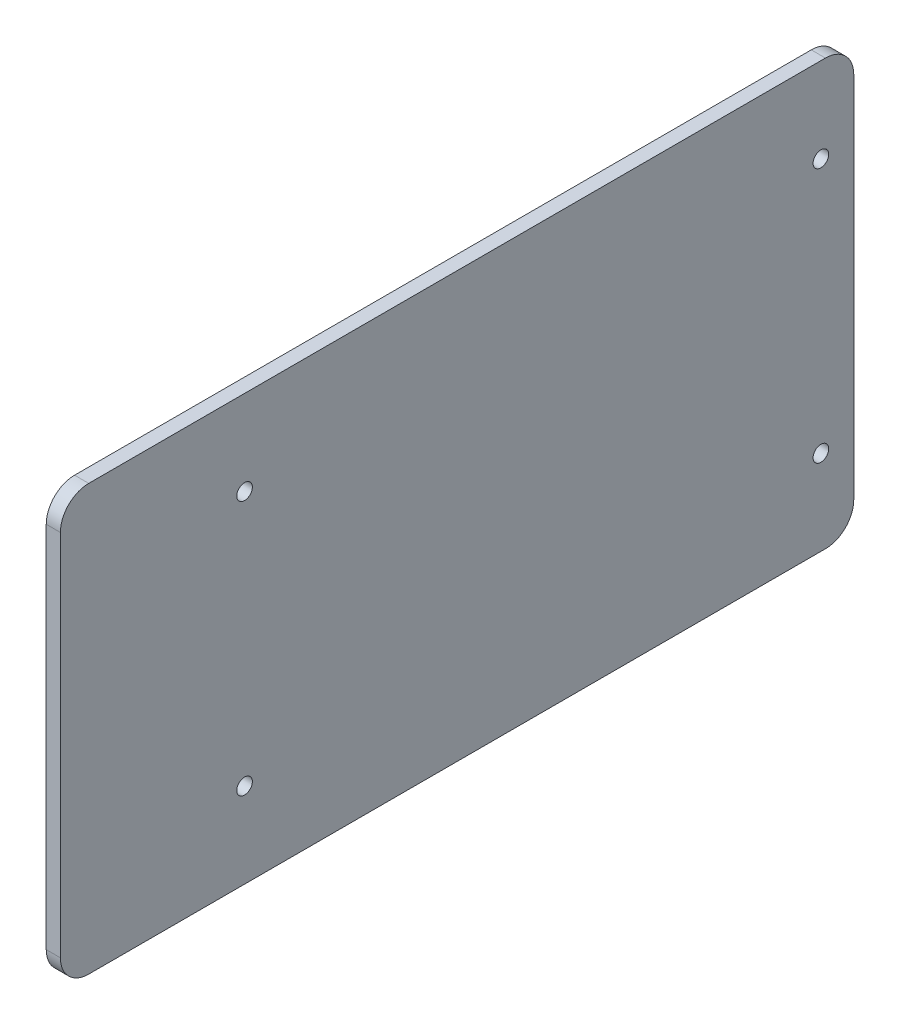
ISO-10303-21;
HEADER;
FILE_DESCRIPTION(('STEP AP214'),'2;1');
FILE_NAME('part.step','',(''),(''),'','','');
FILE_SCHEMA(('AUTOMOTIVE_DESIGN { 1 0 10303 214 1 1 1 1 }'));
ENDSEC;
DATA;
#1=APPLICATION_CONTEXT('core data for automotive mechanical design processes');
#2=APPLICATION_PROTOCOL_DEFINITION('international standard','automotive_design',2000,#1);
#3=PRODUCT_CONTEXT('',#1,'mechanical');
#4=PRODUCT('Part','Part','',(#3));
#5=PRODUCT_RELATED_PRODUCT_CATEGORY('part','',(#4));
#6=PRODUCT_DEFINITION_FORMATION('','',#4);
#7=PRODUCT_DEFINITION_CONTEXT('part definition',#1,'design');
#8=PRODUCT_DEFINITION('design','',#6,#7);
#9=PRODUCT_DEFINITION_SHAPE('','',#8);
#10=(LENGTH_UNIT() NAMED_UNIT(*) SI_UNIT(.MILLI.,.METRE.));
#11=(NAMED_UNIT(*) PLANE_ANGLE_UNIT() SI_UNIT($,.RADIAN.));
#12=(NAMED_UNIT(*) SI_UNIT($,.STERADIAN.) SOLID_ANGLE_UNIT());
#13=UNCERTAINTY_MEASURE_WITH_UNIT(LENGTH_MEASURE(1.E-05),#10,'distance_accuracy_value','');
#14=(GEOMETRIC_REPRESENTATION_CONTEXT(3) GLOBAL_UNCERTAINTY_ASSIGNED_CONTEXT((#13)) GLOBAL_UNIT_ASSIGNED_CONTEXT((#10,
#11,#12)) REPRESENTATION_CONTEXT('',''));
#15=CARTESIAN_POINT('',(0.,0.,0.));
#16=DIRECTION('',(0.,0.,1.));
#17=DIRECTION('',(1.,0.,0.));
#18=AXIS2_PLACEMENT_3D('',#15,#16,#17);
#19=CARTESIAN_POINT('',(1032.6,65.,632.51));
#20=DIRECTION('',(1.,0.,0.));
#21=DIRECTION('',(0.,0.,-1.));
#22=AXIS2_PLACEMENT_3D('',#19,#20,#21);
#23=CYLINDRICAL_SURFACE('',#22,10.);
#24=CARTESIAN_POINT('',(1037.6,65.,632.51));
#25=DIRECTION('',(1.,0.,0.));
#26=DIRECTION('',(0.,0.,1.));
#27=AXIS2_PLACEMENT_3D('',#24,#25,#26);
#28=CIRCLE('',#27,10.);
#29=CARTESIAN_POINT('',(1037.6,65.,622.51));
#30=VERTEX_POINT('',#29);
#31=CARTESIAN_POINT('',(1037.6,75.,632.51));
#32=VERTEX_POINT('',#31);
#33=EDGE_CURVE('E136',#30,#32,#28,.T.);
#34=ORIENTED_EDGE('',*,*,#33,.F.);
#35=DIRECTION('',(1.,0.,0.));
#36=VECTOR('',#35,1.);
#37=CARTESIAN_POINT('',(1032.6,65.,622.51));
#38=LINE('',#37,#36);
#39=CARTESIAN_POINT('',(1032.6,65.,622.51));
#40=VERTEX_POINT('',#39);
#41=EDGE_CURVE('E12',#40,#30,#38,.T.);
#42=ORIENTED_EDGE('',*,*,#41,.F.);
#43=CARTESIAN_POINT('',(1032.6,65.,632.51));
#44=DIRECTION('',(1.,0.,0.));
#45=DIRECTION('',(0.,0.,1.));
#46=AXIS2_PLACEMENT_3D('',#43,#44,#45);
#47=CIRCLE('',#46,10.);
#48=CARTESIAN_POINT('',(1032.6,75.,632.51));
#49=VERTEX_POINT('',#48);
#50=EDGE_CURVE('E157',#40,#49,#47,.T.);
#51=ORIENTED_EDGE('',*,*,#50,.T.);
#52=DIRECTION('',(1.,0.,0.));
#53=VECTOR('',#52,1.);
#54=CARTESIAN_POINT('',(1032.6,75.,632.51));
#55=LINE('',#54,#53);
#56=EDGE_CURVE('E42',#49,#32,#55,.T.);
#57=ORIENTED_EDGE('',*,*,#56,.T.);
#58=EDGE_LOOP('',(#34,#42,#51,#57));
#59=FACE_BOUND('',#58,.T.);
#60=ADVANCED_FACE('F39',(#59),#23,.T.);
#61=CARTESIAN_POINT('',(1032.6,65.,622.51));
#62=DIRECTION('',(0.,0.,-1.));
#63=DIRECTION('',(-1.,0.,0.));
#64=AXIS2_PLACEMENT_3D('',#61,#62,#63);
#65=PLANE('',#64);
#66=DIRECTION('',(0.,1.,0.));
#67=VECTOR('',#66,1.);
#68=CARTESIAN_POINT('',(1037.6,65.,622.51));
#69=LINE('',#68,#67);
#70=CARTESIAN_POINT('',(1037.6,-65.,622.51));
#71=VERTEX_POINT('',#70);
#72=EDGE_CURVE('E155',#71,#30,#69,.T.);
#73=ORIENTED_EDGE('',*,*,#72,.F.);
#74=DIRECTION('',(1.,0.,0.));
#75=VECTOR('',#74,1.);
#76=CARTESIAN_POINT('',(1032.6,-65.,622.51));
#77=LINE('',#76,#75);
#78=CARTESIAN_POINT('',(1032.6,-65.,622.51));
#79=VERTEX_POINT('',#78);
#80=EDGE_CURVE('E48',#79,#71,#77,.T.);
#81=ORIENTED_EDGE('',*,*,#80,.F.);
#82=DIRECTION('',(0.,1.,0.));
#83=VECTOR('',#82,1.);
#84=CARTESIAN_POINT('',(1032.6,65.,622.51));
#85=LINE('',#84,#83);
#86=EDGE_CURVE('E126',#79,#40,#85,.T.);
#87=ORIENTED_EDGE('',*,*,#86,.T.);
#88=ORIENTED_EDGE('',*,*,#41,.T.);
#89=EDGE_LOOP('',(#73,#81,#87,#88));
#90=FACE_BOUND('',#89,.T.);
#91=ADVANCED_FACE('F169',(#90),#65,.T.);
#92=CARTESIAN_POINT('',(1032.6,-65.,632.51));
#93=DIRECTION('',(1.,0.,0.));
#94=DIRECTION('',(0.,0.,-1.));
#95=AXIS2_PLACEMENT_3D('',#92,#93,#94);
#96=CYLINDRICAL_SURFACE('',#95,10.);
#97=CARTESIAN_POINT('',(1037.6,-65.,632.51));
#98=DIRECTION('',(1.,0.,0.));
#99=DIRECTION('',(0.,0.,1.));
#100=AXIS2_PLACEMENT_3D('',#97,#98,#99);
#101=CIRCLE('',#100,10.);
#102=CARTESIAN_POINT('',(1037.6,-75.,632.51));
#103=VERTEX_POINT('',#102);
#104=EDGE_CURVE('E113',#103,#71,#101,.T.);
#105=ORIENTED_EDGE('',*,*,#104,.F.);
#106=DIRECTION('',(1.,0.,0.));
#107=VECTOR('',#106,1.);
#108=CARTESIAN_POINT('',(1032.6,-75.,632.51));
#109=LINE('',#108,#107);
#110=CARTESIAN_POINT('',(1032.6,-75.,632.51));
#111=VERTEX_POINT('',#110);
#112=EDGE_CURVE('E108',#111,#103,#109,.T.);
#113=ORIENTED_EDGE('',*,*,#112,.F.);
#114=CARTESIAN_POINT('',(1032.6,-65.,632.51));
#115=DIRECTION('',(1.,0.,0.));
#116=DIRECTION('',(0.,0.,1.));
#117=AXIS2_PLACEMENT_3D('',#114,#115,#116);
#118=CIRCLE('',#117,10.);
#119=EDGE_CURVE('E111',#111,#79,#118,.T.);
#120=ORIENTED_EDGE('',*,*,#119,.T.);
#121=ORIENTED_EDGE('',*,*,#80,.T.);
#122=EDGE_LOOP('',(#105,#113,#120,#121));
#123=FACE_BOUND('',#122,.T.);
#124=ADVANCED_FACE('F110',(#123),#96,.T.);
#125=CARTESIAN_POINT('',(1032.6,-75.,892.51));
#126=DIRECTION('',(0.,-1.,0.));
#127=DIRECTION('',(0.,0.,-1.));
#128=AXIS2_PLACEMENT_3D('',#125,#126,#127);
#129=PLANE('',#128);
#130=DIRECTION('',(0.,0.,-1.));
#131=VECTOR('',#130,1.);
#132=CARTESIAN_POINT('',(1037.6,-75.,892.51));
#133=LINE('',#132,#131);
#134=CARTESIAN_POINT('',(1037.6,-75.,892.51));
#135=VERTEX_POINT('',#134);
#136=EDGE_CURVE('E152',#135,#103,#133,.T.);
#137=ORIENTED_EDGE('',*,*,#136,.F.);
#138=DIRECTION('',(1.,0.,0.));
#139=VECTOR('',#138,1.);
#140=CARTESIAN_POINT('',(1032.6,-75.,892.51));
#141=LINE('',#140,#139);
#142=CARTESIAN_POINT('',(1032.6,-75.,892.51));
#143=VERTEX_POINT('',#142);
#144=EDGE_CURVE('E118',#143,#135,#141,.T.);
#145=ORIENTED_EDGE('',*,*,#144,.F.);
#146=DIRECTION('',(0.,0.,-1.));
#147=VECTOR('',#146,1.);
#148=CARTESIAN_POINT('',(1032.6,-75.,892.51));
#149=LINE('',#148,#147);
#150=EDGE_CURVE('E124',#143,#111,#149,.T.);
#151=ORIENTED_EDGE('',*,*,#150,.T.);
#152=ORIENTED_EDGE('',*,*,#112,.T.);
#153=EDGE_LOOP('',(#137,#145,#151,#152));
#154=FACE_BOUND('',#153,.T.);
#155=ADVANCED_FACE('F128',(#154),#129,.T.);
#156=CARTESIAN_POINT('',(1032.6,-65.,892.51));
#157=DIRECTION('',(1.,0.,0.));
#158=DIRECTION('',(0.,0.,-1.));
#159=AXIS2_PLACEMENT_3D('',#156,#157,#158);
#160=CYLINDRICAL_SURFACE('',#159,10.);
#161=CARTESIAN_POINT('',(1037.6,-65.,892.51));
#162=DIRECTION('',(1.,0.,0.));
#163=DIRECTION('',(0.,0.,1.));
#164=AXIS2_PLACEMENT_3D('',#161,#162,#163);
#165=CIRCLE('',#164,10.);
#166=CARTESIAN_POINT('',(1037.6,-65.,902.51));
#167=VERTEX_POINT('',#166);
#168=EDGE_CURVE('E149',#167,#135,#165,.T.);
#169=ORIENTED_EDGE('',*,*,#168,.F.);
#170=DIRECTION('',(1.,0.,0.));
#171=VECTOR('',#170,1.);
#172=CARTESIAN_POINT('',(1032.6,-65.,902.51));
#173=LINE('',#172,#171);
#174=CARTESIAN_POINT('',(1032.6,-65.,902.51));
#175=VERTEX_POINT('',#174);
#176=EDGE_CURVE('E161',#175,#167,#173,.T.);
#177=ORIENTED_EDGE('',*,*,#176,.F.);
#178=CARTESIAN_POINT('',(1032.6,-65.,892.51));
#179=DIRECTION('',(1.,0.,0.));
#180=DIRECTION('',(0.,0.,1.));
#181=AXIS2_PLACEMENT_3D('',#178,#179,#180);
#182=CIRCLE('',#181,10.);
#183=EDGE_CURVE('E129',#175,#143,#182,.T.);
#184=ORIENTED_EDGE('',*,*,#183,.T.);
#185=ORIENTED_EDGE('',*,*,#144,.T.);
#186=EDGE_LOOP('',(#169,#177,#184,#185));
#187=FACE_BOUND('',#186,.T.);
#188=ADVANCED_FACE('F182',(#187),#160,.T.);
#189=CARTESIAN_POINT('',(1032.6,65.,902.51));
#190=DIRECTION('',(0.,0.,1.));
#191=DIRECTION('',(1.,0.,0.));
#192=AXIS2_PLACEMENT_3D('',#189,#190,#191);
#193=PLANE('',#192);
#194=DIRECTION('',(0.,-1.,0.));
#195=VECTOR('',#194,1.);
#196=CARTESIAN_POINT('',(1037.6,65.,902.51));
#197=LINE('',#196,#195);
#198=CARTESIAN_POINT('',(1037.6,65.,902.51));
#199=VERTEX_POINT('',#198);
#200=EDGE_CURVE('E146',#199,#167,#197,.T.);
#201=ORIENTED_EDGE('',*,*,#200,.F.);
#202=DIRECTION('',(1.,0.,0.));
#203=VECTOR('',#202,1.);
#204=CARTESIAN_POINT('',(1032.6,65.,902.51));
#205=LINE('',#204,#203);
#206=CARTESIAN_POINT('',(1032.6,65.,902.51));
#207=VERTEX_POINT('',#206);
#208=EDGE_CURVE('E163',#207,#199,#205,.T.);
#209=ORIENTED_EDGE('',*,*,#208,.F.);
#210=DIRECTION('',(0.,-1.,0.));
#211=VECTOR('',#210,1.);
#212=CARTESIAN_POINT('',(1032.6,65.,902.51));
#213=LINE('',#212,#211);
#214=EDGE_CURVE('E131',#207,#175,#213,.T.);
#215=ORIENTED_EDGE('',*,*,#214,.T.);
#216=ORIENTED_EDGE('',*,*,#176,.T.);
#217=EDGE_LOOP('',(#201,#209,#215,#216));
#218=FACE_BOUND('',#217,.T.);
#219=ADVANCED_FACE('F185',(#218),#193,.T.);
#220=CARTESIAN_POINT('',(1032.6,65.,892.51));
#221=DIRECTION('',(1.,0.,0.));
#222=DIRECTION('',(0.,0.,-1.));
#223=AXIS2_PLACEMENT_3D('',#220,#221,#222);
#224=CYLINDRICAL_SURFACE('',#223,10.);
#225=CARTESIAN_POINT('',(1037.6,65.,892.51));
#226=DIRECTION('',(1.,0.,0.));
#227=DIRECTION('',(0.,0.,1.));
#228=AXIS2_PLACEMENT_3D('',#225,#226,#227);
#229=CIRCLE('',#228,10.);
#230=CARTESIAN_POINT('',(1037.6,75.,892.51));
#231=VERTEX_POINT('',#230);
#232=EDGE_CURVE('E143',#231,#199,#229,.T.);
#233=ORIENTED_EDGE('',*,*,#232,.F.);
#234=DIRECTION('',(1.,0.,0.));
#235=VECTOR('',#234,1.);
#236=CARTESIAN_POINT('',(1032.6,75.,892.51));
#237=LINE('',#236,#235);
#238=CARTESIAN_POINT('',(1032.6,75.,892.51));
#239=VERTEX_POINT('',#238);
#240=EDGE_CURVE('E164',#239,#231,#237,.T.);
#241=ORIENTED_EDGE('',*,*,#240,.F.);
#242=CARTESIAN_POINT('',(1032.6,65.,892.51));
#243=DIRECTION('',(1.,0.,0.));
#244=DIRECTION('',(0.,0.,1.));
#245=AXIS2_PLACEMENT_3D('',#242,#243,#244);
#246=CIRCLE('',#245,10.);
#247=EDGE_CURVE('E251',#239,#207,#246,.T.);
#248=ORIENTED_EDGE('',*,*,#247,.T.);
#249=ORIENTED_EDGE('',*,*,#208,.T.);
#250=EDGE_LOOP('',(#233,#241,#248,#249));
#251=FACE_BOUND('',#250,.T.);
#252=ADVANCED_FACE('F189',(#251),#224,.T.);
#253=CARTESIAN_POINT('',(1032.6,75.,892.51));
#254=DIRECTION('',(0.,1.,0.));
#255=DIRECTION('',(0.,0.,1.));
#256=AXIS2_PLACEMENT_3D('',#253,#254,#255);
#257=PLANE('',#256);
#258=DIRECTION('',(0.,0.,1.));
#259=VECTOR('',#258,1.);
#260=CARTESIAN_POINT('',(1037.6,75.,892.51));
#261=LINE('',#260,#259);
#262=EDGE_CURVE('E139',#32,#231,#261,.T.);
#263=ORIENTED_EDGE('',*,*,#262,.F.);
#264=ORIENTED_EDGE('',*,*,#56,.F.);
#265=DIRECTION('',(0.,0.,1.));
#266=VECTOR('',#265,1.);
#267=CARTESIAN_POINT('',(1032.6,75.,892.51));
#268=LINE('',#267,#266);
#269=EDGE_CURVE('E249',#49,#239,#268,.T.);
#270=ORIENTED_EDGE('',*,*,#269,.T.);
#271=ORIENTED_EDGE('',*,*,#240,.T.);
#272=EDGE_LOOP('',(#263,#264,#270,#271));
#273=FACE_BOUND('',#272,.T.);
#274=ADVANCED_FACE('F166',(#273),#257,.T.);
#275=CARTESIAN_POINT('',(1032.6,65.,632.51));
#276=DIRECTION('',(-1.,0.,0.));
#277=DIRECTION('',(0.,0.,1.));
#278=AXIS2_PLACEMENT_3D('',#275,#276,#277);
#279=PLANE('',#278);
#280=CARTESIAN_POINT('',(1032.6,45.,837.51));
#281=DIRECTION('',(-1.,0.,0.));
#282=DIRECTION('',(0.,0.,1.));
#283=AXIS2_PLACEMENT_3D('',#280,#281,#282);
#284=CIRCLE('',#283,2.74999999999999);
#285=CARTESIAN_POINT('',(1032.6,45.,840.26));
#286=VERTEX_POINT('',#285);
#287=EDGE_CURVE('E224',#286,#286,#284,.T.);
#288=ORIENTED_EDGE('',*,*,#287,.F.);
#289=EDGE_LOOP('',(#288));
#290=FACE_BOUND('',#289,.T.);
#291=CARTESIAN_POINT('',(1032.6,-45.,837.51));
#292=DIRECTION('',(-1.,0.,0.));
#293=DIRECTION('',(0.,0.,1.));
#294=AXIS2_PLACEMENT_3D('',#291,#292,#293);
#295=CIRCLE('',#294,2.74999999999999);
#296=CARTESIAN_POINT('',(1032.6,-45.,840.26));
#297=VERTEX_POINT('',#296);
#298=EDGE_CURVE('E228',#297,#297,#295,.T.);
#299=ORIENTED_EDGE('',*,*,#298,.F.);
#300=EDGE_LOOP('',(#299));
#301=FACE_BOUND('',#300,.T.);
#302=CARTESIAN_POINT('',(1032.6,45.,634.12));
#303=DIRECTION('',(-1.,0.,0.));
#304=DIRECTION('',(0.,0.,1.));
#305=AXIS2_PLACEMENT_3D('',#302,#303,#304);
#306=CIRCLE('',#305,2.74999999999999);
#307=CARTESIAN_POINT('',(1032.6,45.,636.87));
#308=VERTEX_POINT('',#307);
#309=EDGE_CURVE('E262',#308,#308,#306,.T.);
#310=ORIENTED_EDGE('',*,*,#309,.F.);
#311=EDGE_LOOP('',(#310));
#312=FACE_BOUND('',#311,.T.);
#313=CARTESIAN_POINT('',(1032.6,-45.,634.12));
#314=DIRECTION('',(-1.,0.,0.));
#315=DIRECTION('',(0.,0.,1.));
#316=AXIS2_PLACEMENT_3D('',#313,#314,#315);
#317=CIRCLE('',#316,2.74999999999999);
#318=CARTESIAN_POINT('',(1032.6,-45.,636.87));
#319=VERTEX_POINT('',#318);
#320=EDGE_CURVE('E240',#319,#319,#317,.T.);
#321=ORIENTED_EDGE('',*,*,#320,.F.);
#322=EDGE_LOOP('',(#321));
#323=FACE_BOUND('',#322,.T.);
#324=ORIENTED_EDGE('',*,*,#50,.F.);
#325=ORIENTED_EDGE('',*,*,#86,.F.);
#326=ORIENTED_EDGE('',*,*,#119,.F.);
#327=ORIENTED_EDGE('',*,*,#150,.F.);
#328=ORIENTED_EDGE('',*,*,#183,.F.);
#329=ORIENTED_EDGE('',*,*,#214,.F.);
#330=ORIENTED_EDGE('',*,*,#247,.F.);
#331=ORIENTED_EDGE('',*,*,#269,.F.);
#332=EDGE_LOOP('',(#324,#325,#326,#327,#328,#329,#330,#331));
#333=FACE_BOUND('',#332,.T.);
#334=ADVANCED_FACE('F122',(#290,#301,#312,#323,#333),#279,.T.);
#335=CARTESIAN_POINT('',(1037.6,65.,632.51));
#336=DIRECTION('',(-1.,0.,0.));
#337=DIRECTION('',(0.,0.,1.));
#338=AXIS2_PLACEMENT_3D('',#335,#336,#337);
#339=PLANE('',#338);
#340=CARTESIAN_POINT('',(1037.6,45.,837.51));
#341=DIRECTION('',(-1.,0.,0.));
#342=DIRECTION('',(0.,0.,1.));
#343=AXIS2_PLACEMENT_3D('',#340,#341,#342);
#344=CIRCLE('',#343,2.74999999999999);
#345=CARTESIAN_POINT('',(1037.6,45.,840.26));
#346=VERTEX_POINT('',#345);
#347=EDGE_CURVE('E227',#346,#346,#344,.T.);
#348=ORIENTED_EDGE('',*,*,#347,.T.);
#349=EDGE_LOOP('',(#348));
#350=FACE_BOUND('',#349,.T.);
#351=CARTESIAN_POINT('',(1037.6,-45.,837.51));
#352=DIRECTION('',(-1.,0.,0.));
#353=DIRECTION('',(0.,0.,1.));
#354=AXIS2_PLACEMENT_3D('',#351,#352,#353);
#355=CIRCLE('',#354,2.74999999999999);
#356=CARTESIAN_POINT('',(1037.6,-45.,840.26));
#357=VERTEX_POINT('',#356);
#358=EDGE_CURVE('E231',#357,#357,#355,.T.);
#359=ORIENTED_EDGE('',*,*,#358,.T.);
#360=EDGE_LOOP('',(#359));
#361=FACE_BOUND('',#360,.T.);
#362=CARTESIAN_POINT('',(1037.6,45.,634.12));
#363=DIRECTION('',(-1.,0.,0.));
#364=DIRECTION('',(0.,0.,1.));
#365=AXIS2_PLACEMENT_3D('',#362,#363,#364);
#366=CIRCLE('',#365,2.74999999999999);
#367=CARTESIAN_POINT('',(1037.6,45.,636.87));
#368=VERTEX_POINT('',#367);
#369=EDGE_CURVE('E245',#368,#368,#366,.T.);
#370=ORIENTED_EDGE('',*,*,#369,.T.);
#371=EDGE_LOOP('',(#370));
#372=FACE_BOUND('',#371,.T.);
#373=CARTESIAN_POINT('',(1037.6,-45.,634.12));
#374=DIRECTION('',(-1.,0.,0.));
#375=DIRECTION('',(0.,0.,1.));
#376=AXIS2_PLACEMENT_3D('',#373,#374,#375);
#377=CIRCLE('',#376,2.74999999999999);
#378=CARTESIAN_POINT('',(1037.6,-45.,636.87));
#379=VERTEX_POINT('',#378);
#380=EDGE_CURVE('E140',#379,#379,#377,.T.);
#381=ORIENTED_EDGE('',*,*,#380,.T.);
#382=EDGE_LOOP('',(#381));
#383=FACE_BOUND('',#382,.T.);
#384=ORIENTED_EDGE('',*,*,#33,.T.);
#385=ORIENTED_EDGE('',*,*,#262,.T.);
#386=ORIENTED_EDGE('',*,*,#232,.T.);
#387=ORIENTED_EDGE('',*,*,#200,.T.);
#388=ORIENTED_EDGE('',*,*,#168,.T.);
#389=ORIENTED_EDGE('',*,*,#136,.T.);
#390=ORIENTED_EDGE('',*,*,#104,.T.);
#391=ORIENTED_EDGE('',*,*,#72,.T.);
#392=EDGE_LOOP('',(#384,#385,#386,#387,#388,#389,#390,#391));
#393=FACE_BOUND('',#392,.T.);
#394=ADVANCED_FACE('F168',(#350,#361,#372,#383,#393),#339,.F.);
#395=CARTESIAN_POINT('',(1032.6,-45.,634.12));
#396=DIRECTION('',(-1.,0.,0.));
#397=DIRECTION('',(0.,0.,1.));
#398=AXIS2_PLACEMENT_3D('',#395,#396,#397);
#399=CYLINDRICAL_SURFACE('',#398,2.74999999999999);
#400=ORIENTED_EDGE('',*,*,#320,.T.);
#401=EDGE_LOOP('',(#400));
#402=FACE_BOUND('',#401,.T.);
#403=ORIENTED_EDGE('',*,*,#380,.F.);
#404=EDGE_LOOP('',(#403));
#405=FACE_BOUND('',#404,.T.);
#406=ADVANCED_FACE('F201',(#402,#405),#399,.F.);
#407=CARTESIAN_POINT('',(1032.6,45.,634.12));
#408=DIRECTION('',(-1.,0.,0.));
#409=DIRECTION('',(0.,0.,1.));
#410=AXIS2_PLACEMENT_3D('',#407,#408,#409);
#411=CYLINDRICAL_SURFACE('',#410,2.74999999999999);
#412=ORIENTED_EDGE('',*,*,#309,.T.);
#413=EDGE_LOOP('',(#412));
#414=FACE_BOUND('',#413,.T.);
#415=ORIENTED_EDGE('',*,*,#369,.F.);
#416=EDGE_LOOP('',(#415));
#417=FACE_BOUND('',#416,.T.);
#418=ADVANCED_FACE('F208',(#414,#417),#411,.F.);
#419=CARTESIAN_POINT('',(1032.6,-45.,837.51));
#420=DIRECTION('',(-1.,0.,0.));
#421=DIRECTION('',(0.,0.,1.));
#422=AXIS2_PLACEMENT_3D('',#419,#420,#421);
#423=CYLINDRICAL_SURFACE('',#422,2.74999999999999);
#424=ORIENTED_EDGE('',*,*,#298,.T.);
#425=EDGE_LOOP('',(#424));
#426=FACE_BOUND('',#425,.T.);
#427=ORIENTED_EDGE('',*,*,#358,.F.);
#428=EDGE_LOOP('',(#427));
#429=FACE_BOUND('',#428,.T.);
#430=ADVANCED_FACE('F212',(#426,#429),#423,.F.);
#431=CARTESIAN_POINT('',(1032.6,45.,837.51));
#432=DIRECTION('',(-1.,0.,0.));
#433=DIRECTION('',(0.,0.,1.));
#434=AXIS2_PLACEMENT_3D('',#431,#432,#433);
#435=CYLINDRICAL_SURFACE('',#434,2.74999999999999);
#436=ORIENTED_EDGE('',*,*,#287,.T.);
#437=EDGE_LOOP('',(#436));
#438=FACE_BOUND('',#437,.T.);
#439=ORIENTED_EDGE('',*,*,#347,.F.);
#440=EDGE_LOOP('',(#439));
#441=FACE_BOUND('',#440,.T.);
#442=ADVANCED_FACE('F216',(#438,#441),#435,.F.);
#443=CLOSED_SHELL('',(#60,#91,#124,#155,#188,#219,#252,#274,#334,#394,#406,#418,#430,#442));
#444=MANIFOLD_SOLID_BREP('B2',#443);
#445=ADVANCED_BREP_SHAPE_REPRESENTATION('',(#18,#444),#14);
#446=SHAPE_DEFINITION_REPRESENTATION(#9,#445);
ENDSEC;
END-ISO-10303-21;
